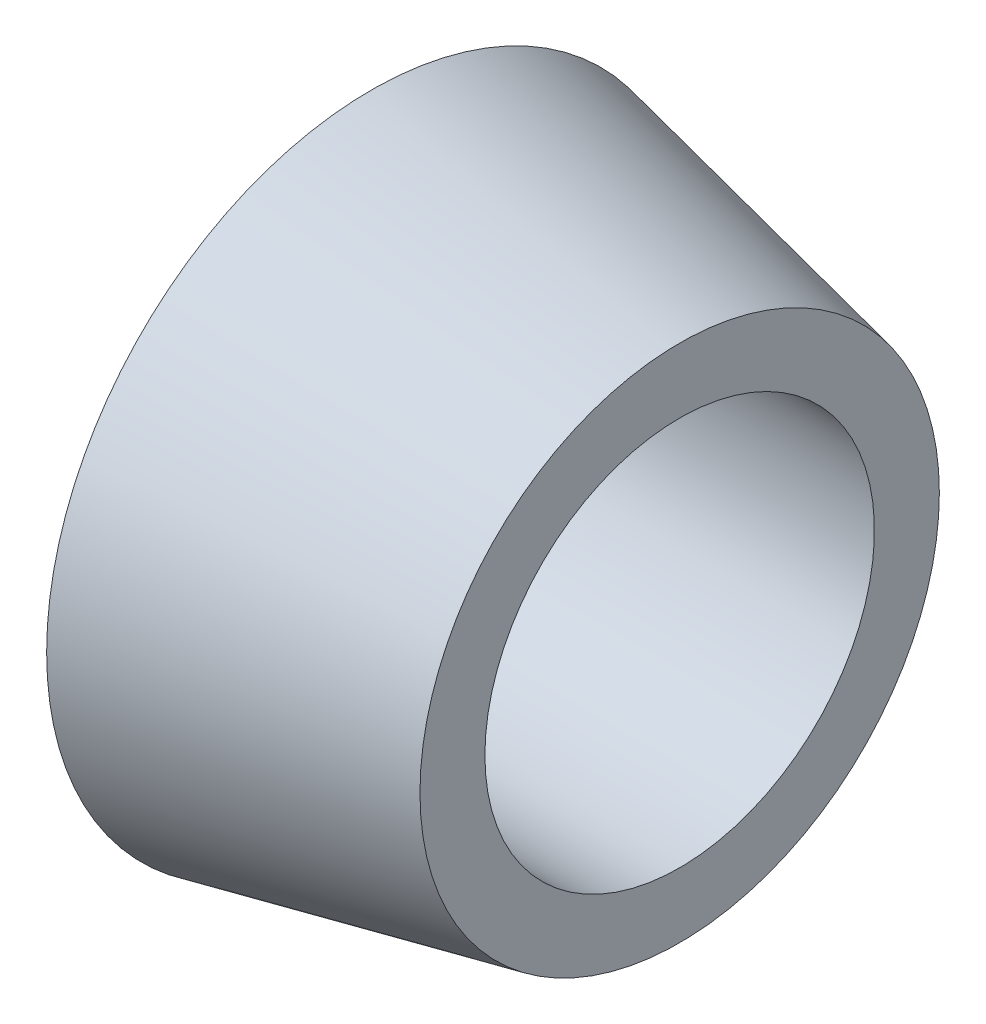
ISO-10303-21;
HEADER;
FILE_DESCRIPTION(('STEP AP214'),'2;1');
FILE_NAME('part.step','',(''),(''),'','','');
FILE_SCHEMA(('AUTOMOTIVE_DESIGN { 1 0 10303 214 1 1 1 1 }'));
ENDSEC;
DATA;
#1=APPLICATION_CONTEXT('core data for automotive mechanical design processes');
#2=APPLICATION_PROTOCOL_DEFINITION('international standard','automotive_design',2000,#1);
#3=PRODUCT_CONTEXT('',#1,'mechanical');
#4=PRODUCT('Part','Part','',(#3));
#5=PRODUCT_RELATED_PRODUCT_CATEGORY('part','',(#4));
#6=PRODUCT_DEFINITION_FORMATION('','',#4);
#7=PRODUCT_DEFINITION_CONTEXT('part definition',#1,'design');
#8=PRODUCT_DEFINITION('design','',#6,#7);
#9=PRODUCT_DEFINITION_SHAPE('','',#8);
#10=(LENGTH_UNIT() NAMED_UNIT(*) SI_UNIT(.MILLI.,.METRE.));
#11=(NAMED_UNIT(*) PLANE_ANGLE_UNIT() SI_UNIT($,.RADIAN.));
#12=(NAMED_UNIT(*) SI_UNIT($,.STERADIAN.) SOLID_ANGLE_UNIT());
#13=UNCERTAINTY_MEASURE_WITH_UNIT(LENGTH_MEASURE(1.E-05),#10,'distance_accuracy_value','');
#14=(GEOMETRIC_REPRESENTATION_CONTEXT(3) GLOBAL_UNCERTAINTY_ASSIGNED_CONTEXT((#13)) GLOBAL_UNIT_ASSIGNED_CONTEXT((#10,
#11,#12)) REPRESENTATION_CONTEXT('',''));
#15=CARTESIAN_POINT('',(0.,0.,0.));
#16=DIRECTION('',(0.,0.,1.));
#17=DIRECTION('',(1.,0.,0.));
#18=AXIS2_PLACEMENT_3D('',#15,#16,#17);
#19=CARTESIAN_POINT('',(0.,0.,0.));
#20=DIRECTION('',(-1.,0.,0.));
#21=DIRECTION('',(0.,0.,1.));
#22=AXIS2_PLACEMENT_3D('',#19,#20,#21);
#23=CYLINDRICAL_SURFACE('',#22,6.);
#24=CARTESIAN_POINT('',(9.5,0.,0.));
#25=DIRECTION('',(-1.,0.,0.));
#26=DIRECTION('',(0.,0.,1.));
#27=AXIS2_PLACEMENT_3D('',#24,#25,#26);
#28=CIRCLE('',#27,6.);
#29=CARTESIAN_POINT('',(9.5,0.,6.));
#30=VERTEX_POINT('',#29);
#31=EDGE_CURVE('E46',#30,#30,#28,.T.);
#32=ORIENTED_EDGE('',*,*,#31,.F.);
#33=EDGE_LOOP('',(#32));
#34=FACE_BOUND('',#33,.T.);
#35=CARTESIAN_POINT('',(0.,0.,0.));
#36=DIRECTION('',(-1.,0.,0.));
#37=DIRECTION('',(0.,0.,1.));
#38=AXIS2_PLACEMENT_3D('',#35,#36,#37);
#39=CIRCLE('',#38,6.);
#40=CARTESIAN_POINT('',(0.,0.,6.));
#41=VERTEX_POINT('',#40);
#42=EDGE_CURVE('E10',#41,#41,#39,.T.);
#43=ORIENTED_EDGE('',*,*,#42,.T.);
#44=EDGE_LOOP('',(#43));
#45=FACE_BOUND('',#44,.T.);
#46=ADVANCED_FACE('F32',(#34,#45),#23,.F.);
#47=CARTESIAN_POINT('',(0.,6.,0.));
#48=DIRECTION('',(1.,0.,0.));
#49=DIRECTION('',(0.,0.,-1.));
#50=AXIS2_PLACEMENT_3D('',#47,#48,#49);
#51=PLANE('',#50);
#52=ORIENTED_EDGE('',*,*,#42,.F.);
#53=EDGE_LOOP('',(#52));
#54=FACE_BOUND('',#53,.T.);
#55=CARTESIAN_POINT('',(0.,0.,0.));
#56=DIRECTION('',(-1.,0.,0.));
#57=DIRECTION('',(0.,0.,1.));
#58=AXIS2_PLACEMENT_3D('',#55,#56,#57);
#59=CIRCLE('',#58,10.);
#60=CARTESIAN_POINT('',(0.,0.,10.));
#61=VERTEX_POINT('',#60);
#62=EDGE_CURVE('E38',#61,#61,#59,.T.);
#63=ORIENTED_EDGE('',*,*,#62,.T.);
#64=EDGE_LOOP('',(#63));
#65=FACE_BOUND('',#64,.T.);
#66=ADVANCED_FACE('F55',(#54,#65),#51,.F.);
#67=CARTESIAN_POINT('',(9.5,0.,0.));
#68=DIRECTION('',(-1.,0.,0.));
#69=DIRECTION('',(0.,0.,1.));
#70=AXIS2_PLACEMENT_3D('',#67,#68,#69);
#71=CONICAL_SURFACE('',#70,8.,0.207496226435203);
#72=ORIENTED_EDGE('',*,*,#62,.F.);
#73=EDGE_LOOP('',(#72));
#74=FACE_BOUND('',#73,.T.);
#75=CARTESIAN_POINT('',(9.5,0.,0.));
#76=DIRECTION('',(-1.,0.,0.));
#77=DIRECTION('',(0.,0.,1.));
#78=AXIS2_PLACEMENT_3D('',#75,#76,#77);
#79=CIRCLE('',#78,8.);
#80=CARTESIAN_POINT('',(9.5,0.,8.));
#81=VERTEX_POINT('',#80);
#82=EDGE_CURVE('E42',#81,#81,#79,.T.);
#83=ORIENTED_EDGE('',*,*,#82,.T.);
#84=EDGE_LOOP('',(#83));
#85=FACE_BOUND('',#84,.T.);
#86=ADVANCED_FACE('F59',(#74,#85),#71,.T.);
#87=CARTESIAN_POINT('',(9.5,8.,0.));
#88=DIRECTION('',(-1.,0.,0.));
#89=DIRECTION('',(0.,0.,1.));
#90=AXIS2_PLACEMENT_3D('',#87,#88,#89);
#91=PLANE('',#90);
#92=ORIENTED_EDGE('',*,*,#82,.F.);
#93=EDGE_LOOP('',(#92));
#94=FACE_BOUND('',#93,.T.);
#95=ORIENTED_EDGE('',*,*,#31,.T.);
#96=EDGE_LOOP('',(#95));
#97=FACE_BOUND('',#96,.T.);
#98=ADVANCED_FACE('F52',(#94,#97),#91,.F.);
#99=CLOSED_SHELL('',(#46,#66,#86,#98));
#100=MANIFOLD_SOLID_BREP('B2',#99);
#101=ADVANCED_BREP_SHAPE_REPRESENTATION('',(#18,#100),#14);
#102=SHAPE_DEFINITION_REPRESENTATION(#9,#101);
ENDSEC;
END-ISO-10303-21;
